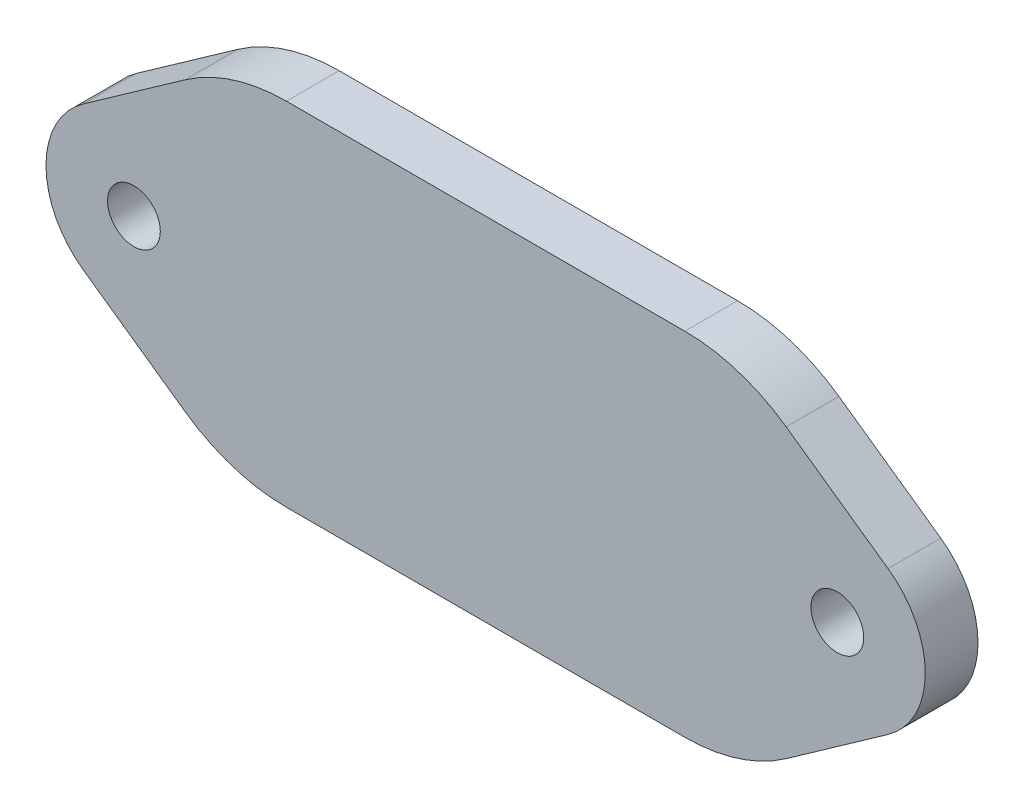
ISO-10303-21;
HEADER;
FILE_DESCRIPTION(('STEP AP214'),'2;1');
FILE_NAME('part.step','',(''),(''),'','','');
FILE_SCHEMA(('AUTOMOTIVE_DESIGN { 1 0 10303 214 1 1 1 1 }'));
ENDSEC;
DATA;
#1=APPLICATION_CONTEXT('core data for automotive mechanical design processes');
#2=APPLICATION_PROTOCOL_DEFINITION('international standard','automotive_design',2000,#1);
#3=PRODUCT_CONTEXT('',#1,'mechanical');
#4=PRODUCT('Part','Part','',(#3));
#5=PRODUCT_RELATED_PRODUCT_CATEGORY('part','',(#4));
#6=PRODUCT_DEFINITION_FORMATION('','',#4);
#7=PRODUCT_DEFINITION_CONTEXT('part definition',#1,'design');
#8=PRODUCT_DEFINITION('design','',#6,#7);
#9=PRODUCT_DEFINITION_SHAPE('','',#8);
#10=(LENGTH_UNIT() NAMED_UNIT(*) SI_UNIT(.MILLI.,.METRE.));
#11=(NAMED_UNIT(*) PLANE_ANGLE_UNIT() SI_UNIT($,.RADIAN.));
#12=(NAMED_UNIT(*) SI_UNIT($,.STERADIAN.) SOLID_ANGLE_UNIT());
#13=UNCERTAINTY_MEASURE_WITH_UNIT(LENGTH_MEASURE(1.E-05),#10,'distance_accuracy_value','');
#14=(GEOMETRIC_REPRESENTATION_CONTEXT(3) GLOBAL_UNCERTAINTY_ASSIGNED_CONTEXT((#13)) GLOBAL_UNIT_ASSIGNED_CONTEXT((#10,
#11,#12)) REPRESENTATION_CONTEXT('',''));
#15=CARTESIAN_POINT('',(0.,0.,0.));
#16=DIRECTION('',(0.,0.,1.));
#17=DIRECTION('',(1.,0.,0.));
#18=AXIS2_PLACEMENT_3D('',#15,#16,#17);
#19=CARTESIAN_POINT('',(-9.53003999182244,13.5066983980679,3.));
#20=DIRECTION('',(-0.576517640256553,0.817084702141104,0.));
#21=DIRECTION('',(-0.817084702141104,-0.576517640256553,0.));
#22=AXIS2_PLACEMENT_3D('',#19,#20,#21);
#23=PLANE('',#22);
#24=DIRECTION('',(0.817084702141104,0.576517640256553,0.));
#25=VECTOR('',#24,1.);
#26=CARTESIAN_POINT('',(-9.53003999182244,13.5066983980679,3.));
#27=LINE('',#26,#25);
#28=CARTESIAN_POINT('',(-22.8825882012828,4.08542351070551,3.));
#29=VERTEX_POINT('',#28);
#30=CARTESIAN_POINT('',(-17.0924148930045,8.17084702141103,3.));
#31=VERTEX_POINT('',#30);
#32=EDGE_CURVE('E127',#29,#31,#27,.T.);
#33=ORIENTED_EDGE('',*,*,#32,.T.);
#34=DIRECTION('',(0.,0.,-1.));
#35=VECTOR('',#34,1.);
#36=CARTESIAN_POINT('',(-17.0924148930045,8.17084702141104,3.));
#37=LINE('',#36,#35);
#38=CARTESIAN_POINT('',(-17.0924148930045,8.17084702141103,0.));
#39=VERTEX_POINT('',#38);
#40=EDGE_CURVE('E226',#31,#39,#37,.T.);
#41=ORIENTED_EDGE('',*,*,#40,.T.);
#42=DIRECTION('',(0.817084702141104,0.576517640256553,0.));
#43=VECTOR('',#42,1.);
#44=CARTESIAN_POINT('',(-9.53003999182244,13.5066983980679,0.));
#45=LINE('',#44,#43);
#46=CARTESIAN_POINT('',(-22.8825882012828,4.08542351070551,0.));
#47=VERTEX_POINT('',#46);
#48=EDGE_CURVE('E130',#47,#39,#45,.T.);
#49=ORIENTED_EDGE('',*,*,#48,.F.);
#50=DIRECTION('',(0.,0.,-1.));
#51=VECTOR('',#50,1.);
#52=CARTESIAN_POINT('',(-22.8825882012828,4.08542351070551,3.));
#53=LINE('',#52,#51);
#54=EDGE_CURVE('E123',#29,#47,#53,.T.);
#55=ORIENTED_EDGE('',*,*,#54,.F.);
#56=EDGE_LOOP('',(#33,#41,#49,#55));
#57=FACE_BOUND('',#56,.T.);
#58=ADVANCED_FACE('F34',(#57),#23,.T.);
#59=CARTESIAN_POINT('',(-20.,0.,3.));
#60=DIRECTION('',(0.,0.,-1.));
#61=DIRECTION('',(-1.,0.,0.));
#62=AXIS2_PLACEMENT_3D('',#59,#60,#61);
#63=CYLINDRICAL_SURFACE('',#62,5.);
#64=CARTESIAN_POINT('',(-20.,0.,0.));
#65=DIRECTION('',(0.,0.,1.));
#66=DIRECTION('',(1.,0.,0.));
#67=AXIS2_PLACEMENT_3D('',#64,#65,#66);
#68=CIRCLE('',#67,5.);
#69=CARTESIAN_POINT('',(-22.8825882012828,-4.08542351070551,0.));
#70=VERTEX_POINT('',#69);
#71=EDGE_CURVE('E177',#47,#70,#68,.T.);
#72=ORIENTED_EDGE('',*,*,#71,.T.);
#73=DIRECTION('',(0.,0.,-1.));
#74=VECTOR('',#73,1.);
#75=CARTESIAN_POINT('',(-22.8825882012828,-4.08542351070551,3.));
#76=LINE('',#75,#74);
#77=CARTESIAN_POINT('',(-22.8825882012828,-4.08542351070551,3.));
#78=VERTEX_POINT('',#77);
#79=EDGE_CURVE('E135',#78,#70,#76,.T.);
#80=ORIENTED_EDGE('',*,*,#79,.F.);
#81=CARTESIAN_POINT('',(-20.,0.,3.));
#82=DIRECTION('',(0.,0.,1.));
#83=DIRECTION('',(1.,0.,0.));
#84=AXIS2_PLACEMENT_3D('',#81,#82,#83);
#85=CIRCLE('',#84,5.);
#86=EDGE_CURVE('E139',#29,#78,#85,.T.);
#87=ORIENTED_EDGE('',*,*,#86,.F.);
#88=ORIENTED_EDGE('',*,*,#54,.T.);
#89=EDGE_LOOP('',(#72,#80,#87,#88));
#90=FACE_BOUND('',#89,.T.);
#91=ADVANCED_FACE('F140',(#90),#63,.T.);
#92=CARTESIAN_POINT('',(-9.53003999182244,-13.5066983980679,3.));
#93=DIRECTION('',(0.576517640256553,0.817084702141104,0.));
#94=DIRECTION('',(-0.817084702141104,0.576517640256553,0.));
#95=AXIS2_PLACEMENT_3D('',#92,#93,#94);
#96=PLANE('',#95);
#97=DIRECTION('',(0.817084702141104,-0.576517640256553,0.));
#98=VECTOR('',#97,1.);
#99=CARTESIAN_POINT('',(-9.53003999182244,-13.5066983980679,0.));
#100=LINE('',#99,#98);
#101=CARTESIAN_POINT('',(-17.0924148930045,-8.17084702141103,0.));
#102=VERTEX_POINT('',#101);
#103=EDGE_CURVE('E179',#70,#102,#100,.T.);
#104=ORIENTED_EDGE('',*,*,#103,.T.);
#105=DIRECTION('',(0.,0.,-1.));
#106=VECTOR('',#105,1.);
#107=CARTESIAN_POINT('',(-17.0924148930045,-8.17084702141103,3.));
#108=LINE('',#107,#106);
#109=CARTESIAN_POINT('',(-17.0924148930045,-8.17084702141103,3.));
#110=VERTEX_POINT('',#109);
#111=EDGE_CURVE('E224',#102,#110,#108,.F.);
#112=ORIENTED_EDGE('',*,*,#111,.T.);
#113=DIRECTION('',(0.817084702141104,-0.576517640256553,0.));
#114=VECTOR('',#113,1.);
#115=CARTESIAN_POINT('',(-9.53003999182244,-13.5066983980679,3.));
#116=LINE('',#115,#114);
#117=EDGE_CURVE('E143',#78,#110,#116,.T.);
#118=ORIENTED_EDGE('',*,*,#117,.F.);
#119=ORIENTED_EDGE('',*,*,#79,.T.);
#120=EDGE_LOOP('',(#104,#112,#118,#119));
#121=FACE_BOUND('',#120,.T.);
#122=ADVANCED_FACE('F253',(#121),#96,.F.);
#123=CARTESIAN_POINT('',(0.,-10.,3.));
#124=DIRECTION('',(0.,1.,0.));
#125=DIRECTION('',(0.,0.,1.));
#126=AXIS2_PLACEMENT_3D('',#123,#124,#125);
#127=PLANE('',#126);
#128=DIRECTION('',(1.,0.,0.));
#129=VECTOR('',#128,1.);
#130=CARTESIAN_POINT('',(0.,-10.,0.));
#131=LINE('',#130,#129);
#132=CARTESIAN_POINT('',(-11.3272384904389,-10.,0.));
#133=VERTEX_POINT('',#132);
#134=CARTESIAN_POINT('',(11.3272384904389,-10.,0.));
#135=VERTEX_POINT('',#134);
#136=EDGE_CURVE('E182',#133,#135,#131,.T.);
#137=ORIENTED_EDGE('',*,*,#136,.T.);
#138=DIRECTION('',(0.,0.,-1.));
#139=VECTOR('',#138,1.);
#140=CARTESIAN_POINT('',(11.3272384904389,-10.,3.));
#141=LINE('',#140,#139);
#142=CARTESIAN_POINT('',(11.3272384904389,-10.,3.));
#143=VERTEX_POINT('',#142);
#144=EDGE_CURVE('E216',#135,#143,#141,.F.);
#145=ORIENTED_EDGE('',*,*,#144,.T.);
#146=DIRECTION('',(1.,0.,0.));
#147=VECTOR('',#146,1.);
#148=CARTESIAN_POINT('',(0.,-10.,3.));
#149=LINE('',#148,#147);
#150=CARTESIAN_POINT('',(-11.3272384904389,-10.,3.));
#151=VERTEX_POINT('',#150);
#152=EDGE_CURVE('E157',#151,#143,#149,.T.);
#153=ORIENTED_EDGE('',*,*,#152,.F.);
#154=DIRECTION('',(0.,0.,-1.));
#155=VECTOR('',#154,1.);
#156=CARTESIAN_POINT('',(-11.3272384904389,-10.,3.));
#157=LINE('',#156,#155);
#158=EDGE_CURVE('E213',#151,#133,#157,.T.);
#159=ORIENTED_EDGE('',*,*,#158,.T.);
#160=EDGE_LOOP('',(#137,#145,#153,#159));
#161=FACE_BOUND('',#160,.T.);
#162=ADVANCED_FACE('F287',(#161),#127,.F.);
#163=CARTESIAN_POINT('',(9.53003999182244,-13.5066983980679,3.));
#164=DIRECTION('',(0.576517640256553,-0.817084702141104,0.));
#165=DIRECTION('',(0.817084702141104,0.576517640256553,0.));
#166=AXIS2_PLACEMENT_3D('',#163,#164,#165);
#167=PLANE('',#166);
#168=DIRECTION('',(-0.817084702141104,-0.576517640256553,0.));
#169=VECTOR('',#168,1.);
#170=CARTESIAN_POINT('',(9.53003999182244,-13.5066983980679,3.));
#171=LINE('',#170,#169);
#172=CARTESIAN_POINT('',(22.8825882012828,-4.08542351070552,3.));
#173=VERTEX_POINT('',#172);
#174=CARTESIAN_POINT('',(17.0924148930045,-8.17084702141104,3.));
#175=VERTEX_POINT('',#174);
#176=EDGE_CURVE('E159',#173,#175,#171,.T.);
#177=ORIENTED_EDGE('',*,*,#176,.T.);
#178=DIRECTION('',(0.,0.,-1.));
#179=VECTOR('',#178,1.);
#180=CARTESIAN_POINT('',(17.0924148930045,-8.17084702141103,0.));
#181=LINE('',#180,#179);
#182=CARTESIAN_POINT('',(17.0924148930045,-8.17084702141104,0.));
#183=VERTEX_POINT('',#182);
#184=EDGE_CURVE('E134',#175,#183,#181,.T.);
#185=ORIENTED_EDGE('',*,*,#184,.T.);
#186=DIRECTION('',(-0.817084702141104,-0.576517640256553,0.));
#187=VECTOR('',#186,1.);
#188=CARTESIAN_POINT('',(9.53003999182244,-13.5066983980679,0.));
#189=LINE('',#188,#187);
#190=CARTESIAN_POINT('',(22.8825882012828,-4.08542351070552,0.));
#191=VERTEX_POINT('',#190);
#192=EDGE_CURVE('E185',#191,#183,#189,.T.);
#193=ORIENTED_EDGE('',*,*,#192,.F.);
#194=DIRECTION('',(0.,0.,-1.));
#195=VECTOR('',#194,1.);
#196=CARTESIAN_POINT('',(22.8825882012828,-4.08542351070552,3.));
#197=LINE('',#196,#195);
#198=EDGE_CURVE('E200',#173,#191,#197,.T.);
#199=ORIENTED_EDGE('',*,*,#198,.F.);
#200=EDGE_LOOP('',(#177,#185,#193,#199));
#201=FACE_BOUND('',#200,.T.);
#202=ADVANCED_FACE('F276',(#201),#167,.T.);
#203=CARTESIAN_POINT('',(20.,0.,3.));
#204=DIRECTION('',(0.,0.,-1.));
#205=DIRECTION('',(-1.,0.,0.));
#206=AXIS2_PLACEMENT_3D('',#203,#204,#205);
#207=CYLINDRICAL_SURFACE('',#206,5.);
#208=CARTESIAN_POINT('',(20.,0.,0.));
#209=DIRECTION('',(0.,0.,1.));
#210=DIRECTION('',(1.,0.,0.));
#211=AXIS2_PLACEMENT_3D('',#208,#209,#210);
#212=CIRCLE('',#211,5.);
#213=CARTESIAN_POINT('',(22.8825882012828,4.08542351070552,0.));
#214=VERTEX_POINT('',#213);
#215=EDGE_CURVE('E188',#214,#191,#212,.F.);
#216=ORIENTED_EDGE('',*,*,#215,.F.);
#217=DIRECTION('',(0.,0.,-1.));
#218=VECTOR('',#217,1.);
#219=CARTESIAN_POINT('',(22.8825882012828,4.08542351070552,3.));
#220=LINE('',#219,#218);
#221=CARTESIAN_POINT('',(22.8825882012828,4.08542351070552,3.));
#222=VERTEX_POINT('',#221);
#223=EDGE_CURVE('E172',#222,#214,#220,.T.);
#224=ORIENTED_EDGE('',*,*,#223,.F.);
#225=CARTESIAN_POINT('',(20.,0.,3.));
#226=DIRECTION('',(0.,0.,1.));
#227=DIRECTION('',(1.,0.,0.));
#228=AXIS2_PLACEMENT_3D('',#225,#226,#227);
#229=CIRCLE('',#228,5.);
#230=EDGE_CURVE('E162',#222,#173,#229,.F.);
#231=ORIENTED_EDGE('',*,*,#230,.T.);
#232=ORIENTED_EDGE('',*,*,#198,.T.);
#233=EDGE_LOOP('',(#216,#224,#231,#232));
#234=FACE_BOUND('',#233,.T.);
#235=ADVANCED_FACE('F280',(#234),#207,.T.);
#236=CARTESIAN_POINT('',(9.53003999182244,13.5066983980679,3.));
#237=DIRECTION('',(-0.576517640256553,-0.817084702141104,0.));
#238=DIRECTION('',(0.817084702141104,-0.576517640256553,0.));
#239=AXIS2_PLACEMENT_3D('',#236,#237,#238);
#240=PLANE('',#239);
#241=DIRECTION('',(-0.817084702141104,0.576517640256553,0.));
#242=VECTOR('',#241,1.);
#243=CARTESIAN_POINT('',(9.53003999182244,13.5066983980679,0.));
#244=LINE('',#243,#242);
#245=CARTESIAN_POINT('',(17.0924148930045,8.17084702141104,0.));
#246=VERTEX_POINT('',#245);
#247=EDGE_CURVE('E191',#214,#246,#244,.T.);
#248=ORIENTED_EDGE('',*,*,#247,.T.);
#249=DIRECTION('',(0.,0.,-1.));
#250=VECTOR('',#249,1.);
#251=CARTESIAN_POINT('',(17.0924148930045,8.17084702141103,3.));
#252=LINE('',#251,#250);
#253=CARTESIAN_POINT('',(17.0924148930045,8.17084702141104,3.));
#254=VERTEX_POINT('',#253);
#255=EDGE_CURVE('E11',#246,#254,#252,.F.);
#256=ORIENTED_EDGE('',*,*,#255,.T.);
#257=DIRECTION('',(-0.817084702141104,0.576517640256553,0.));
#258=VECTOR('',#257,1.);
#259=CARTESIAN_POINT('',(9.53003999182244,13.5066983980679,3.));
#260=LINE('',#259,#258);
#261=EDGE_CURVE('E165',#222,#254,#260,.T.);
#262=ORIENTED_EDGE('',*,*,#261,.F.);
#263=ORIENTED_EDGE('',*,*,#223,.T.);
#264=EDGE_LOOP('',(#248,#256,#262,#263));
#265=FACE_BOUND('',#264,.T.);
#266=ADVANCED_FACE('F284',(#265),#240,.F.);
#267=CARTESIAN_POINT('',(0.,10.,3.));
#268=DIRECTION('',(0.,1.,0.));
#269=DIRECTION('',(0.,0.,1.));
#270=AXIS2_PLACEMENT_3D('',#267,#268,#269);
#271=PLANE('',#270);
#272=DIRECTION('',(1.,0.,0.));
#273=VECTOR('',#272,1.);
#274=CARTESIAN_POINT('',(0.,10.,0.));
#275=LINE('',#274,#273);
#276=CARTESIAN_POINT('',(-11.3272384904389,10.,0.));
#277=VERTEX_POINT('',#276);
#278=CARTESIAN_POINT('',(11.3272384904389,10.,0.));
#279=VERTEX_POINT('',#278);
#280=EDGE_CURVE('E194',#277,#279,#275,.T.);
#281=ORIENTED_EDGE('',*,*,#280,.F.);
#282=DIRECTION('',(0.,0.,-1.));
#283=VECTOR('',#282,1.);
#284=CARTESIAN_POINT('',(-11.3272384904389,10.,3.));
#285=LINE('',#284,#283);
#286=CARTESIAN_POINT('',(-11.3272384904389,10.,3.));
#287=VERTEX_POINT('',#286);
#288=EDGE_CURVE('E42',#277,#287,#285,.F.);
#289=ORIENTED_EDGE('',*,*,#288,.T.);
#290=DIRECTION('',(1.,0.,0.));
#291=VECTOR('',#290,1.);
#292=CARTESIAN_POINT('',(0.,10.,3.));
#293=LINE('',#292,#291);
#294=CARTESIAN_POINT('',(11.3272384904389,10.,3.));
#295=VERTEX_POINT('',#294);
#296=EDGE_CURVE('E167',#287,#295,#293,.T.);
#297=ORIENTED_EDGE('',*,*,#296,.T.);
#298=DIRECTION('',(0.,0.,-1.));
#299=VECTOR('',#298,1.);
#300=CARTESIAN_POINT('',(11.3272384904389,10.,0.));
#301=LINE('',#300,#299);
#302=EDGE_CURVE('E228',#295,#279,#301,.T.);
#303=ORIENTED_EDGE('',*,*,#302,.T.);
#304=EDGE_LOOP('',(#281,#289,#297,#303));
#305=FACE_BOUND('',#304,.T.);
#306=ADVANCED_FACE('F231',(#305),#271,.T.);
#307=CARTESIAN_POINT('',(-20.,0.,3.));
#308=DIRECTION('',(0.,0.,-1.));
#309=DIRECTION('',(-1.,0.,0.));
#310=AXIS2_PLACEMENT_3D('',#307,#308,#309);
#311=CYLINDRICAL_SURFACE('',#310,1.5);
#312=CARTESIAN_POINT('',(-20.,0.,3.));
#313=DIRECTION('',(0.,0.,1.));
#314=DIRECTION('',(1.,0.,0.));
#315=AXIS2_PLACEMENT_3D('',#312,#313,#314);
#316=CIRCLE('',#315,1.5);
#317=CARTESIAN_POINT('',(-18.5,0.,3.));
#318=VERTEX_POINT('',#317);
#319=EDGE_CURVE('E150',#318,#318,#316,.T.);
#320=ORIENTED_EDGE('',*,*,#319,.T.);
#321=EDGE_LOOP('',(#320));
#322=FACE_BOUND('',#321,.T.);
#323=CARTESIAN_POINT('',(-20.,0.,0.));
#324=DIRECTION('',(0.,0.,1.));
#325=DIRECTION('',(1.,0.,0.));
#326=AXIS2_PLACEMENT_3D('',#323,#324,#325);
#327=CIRCLE('',#326,1.5);
#328=CARTESIAN_POINT('',(-18.5,0.,0.));
#329=VERTEX_POINT('',#328);
#330=EDGE_CURVE('E173',#329,#329,#327,.T.);
#331=ORIENTED_EDGE('',*,*,#330,.F.);
#332=EDGE_LOOP('',(#331));
#333=FACE_BOUND('',#332,.T.);
#334=ADVANCED_FACE('F257',(#322,#333),#311,.F.);
#335=CARTESIAN_POINT('',(20.,0.,3.));
#336=DIRECTION('',(0.,0.,-1.));
#337=DIRECTION('',(-1.,0.,0.));
#338=AXIS2_PLACEMENT_3D('',#335,#336,#337);
#339=CYLINDRICAL_SURFACE('',#338,1.5);
#340=CARTESIAN_POINT('',(20.,0.,3.));
#341=DIRECTION('',(0.,0.,1.));
#342=DIRECTION('',(1.,0.,0.));
#343=AXIS2_PLACEMENT_3D('',#340,#341,#342);
#344=CIRCLE('',#343,1.5);
#345=CARTESIAN_POINT('',(21.5,0.,3.));
#346=VERTEX_POINT('',#345);
#347=EDGE_CURVE('E169',#346,#346,#344,.F.);
#348=ORIENTED_EDGE('',*,*,#347,.F.);
#349=EDGE_LOOP('',(#348));
#350=FACE_BOUND('',#349,.T.);
#351=CARTESIAN_POINT('',(20.,0.,0.));
#352=DIRECTION('',(0.,0.,1.));
#353=DIRECTION('',(1.,0.,0.));
#354=AXIS2_PLACEMENT_3D('',#351,#352,#353);
#355=CIRCLE('',#354,1.5);
#356=CARTESIAN_POINT('',(21.5,0.,0.));
#357=VERTEX_POINT('',#356);
#358=EDGE_CURVE('E153',#357,#357,#355,.F.);
#359=ORIENTED_EDGE('',*,*,#358,.T.);
#360=EDGE_LOOP('',(#359));
#361=FACE_BOUND('',#360,.T.);
#362=ADVANCED_FACE('F260',(#350,#361),#339,.F.);
#363=CARTESIAN_POINT('',(0.,0.,3.));
#364=DIRECTION('',(0.,0.,1.));
#365=DIRECTION('',(1.,0.,0.));
#366=AXIS2_PLACEMENT_3D('',#363,#364,#365);
#367=PLANE('',#366);
#368=ORIENTED_EDGE('',*,*,#319,.F.);
#369=EDGE_LOOP('',(#368));
#370=FACE_BOUND('',#369,.T.);
#371=ORIENTED_EDGE('',*,*,#152,.T.);
#372=CARTESIAN_POINT('',(11.3272384904389,0.,3.));
#373=DIRECTION('',(0.,0.,1.));
#374=DIRECTION('',(1.,0.,0.));
#375=AXIS2_PLACEMENT_3D('',#372,#373,#374);
#376=CIRCLE('',#375,10.);
#377=EDGE_CURVE('E222',#143,#175,#376,.T.);
#378=ORIENTED_EDGE('',*,*,#377,.T.);
#379=ORIENTED_EDGE('',*,*,#176,.F.);
#380=ORIENTED_EDGE('',*,*,#230,.F.);
#381=ORIENTED_EDGE('',*,*,#261,.T.);
#382=CARTESIAN_POINT('',(11.3272384904389,0.,3.));
#383=DIRECTION('',(0.,0.,1.));
#384=DIRECTION('',(1.,0.,0.));
#385=AXIS2_PLACEMENT_3D('',#382,#383,#384);
#386=CIRCLE('',#385,10.);
#387=EDGE_CURVE('E49',#254,#295,#386,.T.);
#388=ORIENTED_EDGE('',*,*,#387,.T.);
#389=ORIENTED_EDGE('',*,*,#296,.F.);
#390=CARTESIAN_POINT('',(-11.3272384904389,0.,3.));
#391=DIRECTION('',(0.,0.,1.));
#392=DIRECTION('',(1.,0.,0.));
#393=AXIS2_PLACEMENT_3D('',#390,#391,#392);
#394=CIRCLE('',#393,10.);
#395=EDGE_CURVE('E149',#287,#31,#394,.T.);
#396=ORIENTED_EDGE('',*,*,#395,.T.);
#397=ORIENTED_EDGE('',*,*,#32,.F.);
#398=ORIENTED_EDGE('',*,*,#86,.T.);
#399=ORIENTED_EDGE('',*,*,#117,.T.);
#400=CARTESIAN_POINT('',(-11.3272384904389,0.,3.));
#401=DIRECTION('',(0.,0.,1.));
#402=DIRECTION('',(1.,0.,0.));
#403=AXIS2_PLACEMENT_3D('',#400,#401,#402);
#404=CIRCLE('',#403,10.);
#405=EDGE_CURVE('E220',#110,#151,#404,.T.);
#406=ORIENTED_EDGE('',*,*,#405,.T.);
#407=EDGE_LOOP('',(#371,#378,#379,#380,#381,#388,#389,#396,#397,#398,#399,#406));
#408=FACE_BOUND('',#407,.T.);
#409=ORIENTED_EDGE('',*,*,#347,.T.);
#410=EDGE_LOOP('',(#409));
#411=FACE_BOUND('',#410,.T.);
#412=ADVANCED_FACE('F146',(#370,#408,#411),#367,.T.);
#413=CARTESIAN_POINT('',(0.,0.,0.));
#414=DIRECTION('',(0.,0.,1.));
#415=DIRECTION('',(1.,0.,0.));
#416=AXIS2_PLACEMENT_3D('',#413,#414,#415);
#417=PLANE('',#416);
#418=ORIENTED_EDGE('',*,*,#330,.T.);
#419=EDGE_LOOP('',(#418));
#420=FACE_BOUND('',#419,.T.);
#421=ORIENTED_EDGE('',*,*,#192,.T.);
#422=CARTESIAN_POINT('',(11.3272384904389,0.,0.));
#423=DIRECTION('',(0.,0.,1.));
#424=DIRECTION('',(1.,0.,0.));
#425=AXIS2_PLACEMENT_3D('',#422,#423,#424);
#426=CIRCLE('',#425,10.);
#427=EDGE_CURVE('E211',#183,#135,#426,.F.);
#428=ORIENTED_EDGE('',*,*,#427,.T.);
#429=ORIENTED_EDGE('',*,*,#136,.F.);
#430=CARTESIAN_POINT('',(-11.3272384904389,0.,0.));
#431=DIRECTION('',(0.,0.,1.));
#432=DIRECTION('',(1.,0.,0.));
#433=AXIS2_PLACEMENT_3D('',#430,#431,#432);
#434=CIRCLE('',#433,10.);
#435=EDGE_CURVE('E209',#133,#102,#434,.F.);
#436=ORIENTED_EDGE('',*,*,#435,.T.);
#437=ORIENTED_EDGE('',*,*,#103,.F.);
#438=ORIENTED_EDGE('',*,*,#71,.F.);
#439=ORIENTED_EDGE('',*,*,#48,.T.);
#440=CARTESIAN_POINT('',(-11.3272384904389,0.,0.));
#441=DIRECTION('',(0.,0.,1.));
#442=DIRECTION('',(1.,0.,0.));
#443=AXIS2_PLACEMENT_3D('',#440,#441,#442);
#444=CIRCLE('',#443,10.);
#445=EDGE_CURVE('E207',#39,#277,#444,.F.);
#446=ORIENTED_EDGE('',*,*,#445,.T.);
#447=ORIENTED_EDGE('',*,*,#280,.T.);
#448=CARTESIAN_POINT('',(11.3272384904389,0.,0.));
#449=DIRECTION('',(0.,0.,1.));
#450=DIRECTION('',(1.,0.,0.));
#451=AXIS2_PLACEMENT_3D('',#448,#449,#450);
#452=CIRCLE('',#451,10.);
#453=EDGE_CURVE('E205',#279,#246,#452,.F.);
#454=ORIENTED_EDGE('',*,*,#453,.T.);
#455=ORIENTED_EDGE('',*,*,#247,.F.);
#456=ORIENTED_EDGE('',*,*,#215,.T.);
#457=EDGE_LOOP('',(#421,#428,#429,#436,#437,#438,#439,#446,#447,#454,#455,#456));
#458=FACE_BOUND('',#457,.T.);
#459=ORIENTED_EDGE('',*,*,#358,.F.);
#460=EDGE_LOOP('',(#459));
#461=FACE_BOUND('',#460,.T.);
#462=ADVANCED_FACE('F234',(#420,#458,#461),#417,.F.);
#463=CARTESIAN_POINT('',(11.3272384904389,0.,3.));
#464=DIRECTION('',(0.,0.,1.));
#465=DIRECTION('',(1.,0.,0.));
#466=AXIS2_PLACEMENT_3D('',#463,#464,#465);
#467=CYLINDRICAL_SURFACE('',#466,10.);
#468=ORIENTED_EDGE('',*,*,#377,.F.);
#469=ORIENTED_EDGE('',*,*,#144,.F.);
#470=ORIENTED_EDGE('',*,*,#427,.F.);
#471=ORIENTED_EDGE('',*,*,#184,.F.);
#472=EDGE_LOOP('',(#468,#469,#470,#471));
#473=FACE_BOUND('',#472,.T.);
#474=ADVANCED_FACE('F245',(#473),#467,.T.);
#475=CARTESIAN_POINT('',(-11.3272384904389,0.,3.));
#476=DIRECTION('',(0.,0.,-1.));
#477=DIRECTION('',(-1.,0.,0.));
#478=AXIS2_PLACEMENT_3D('',#475,#476,#477);
#479=CYLINDRICAL_SURFACE('',#478,10.);
#480=ORIENTED_EDGE('',*,*,#405,.F.);
#481=ORIENTED_EDGE('',*,*,#111,.F.);
#482=ORIENTED_EDGE('',*,*,#435,.F.);
#483=ORIENTED_EDGE('',*,*,#158,.F.);
#484=EDGE_LOOP('',(#480,#481,#482,#483));
#485=FACE_BOUND('',#484,.T.);
#486=ADVANCED_FACE('F240',(#485),#479,.T.);
#487=CARTESIAN_POINT('',(-11.3272384904389,0.,3.));
#488=DIRECTION('',(0.,0.,-1.));
#489=DIRECTION('',(-1.,0.,0.));
#490=AXIS2_PLACEMENT_3D('',#487,#488,#489);
#491=CYLINDRICAL_SURFACE('',#490,10.);
#492=ORIENTED_EDGE('',*,*,#395,.F.);
#493=ORIENTED_EDGE('',*,*,#288,.F.);
#494=ORIENTED_EDGE('',*,*,#445,.F.);
#495=ORIENTED_EDGE('',*,*,#40,.F.);
#496=EDGE_LOOP('',(#492,#493,#494,#495));
#497=FACE_BOUND('',#496,.T.);
#498=ADVANCED_FACE('F238',(#497),#491,.T.);
#499=CARTESIAN_POINT('',(11.3272384904389,0.,3.));
#500=DIRECTION('',(0.,0.,1.));
#501=DIRECTION('',(1.,0.,0.));
#502=AXIS2_PLACEMENT_3D('',#499,#500,#501);
#503=CYLINDRICAL_SURFACE('',#502,10.);
#504=ORIENTED_EDGE('',*,*,#387,.F.);
#505=ORIENTED_EDGE('',*,*,#255,.F.);
#506=ORIENTED_EDGE('',*,*,#453,.F.);
#507=ORIENTED_EDGE('',*,*,#302,.F.);
#508=EDGE_LOOP('',(#504,#505,#506,#507));
#509=FACE_BOUND('',#508,.T.);
#510=ADVANCED_FACE('F36',(#509),#503,.T.);
#511=CLOSED_SHELL('',(#58,#91,#122,#162,#202,#235,#266,#306,#334,#362,#412,#462,#474,#486,#498,#510));
#512=MANIFOLD_SOLID_BREP('B2',#511);
#513=ADVANCED_BREP_SHAPE_REPRESENTATION('',(#18,#512),#14);
#514=SHAPE_DEFINITION_REPRESENTATION(#9,#513);
ENDSEC;
END-ISO-10303-21;
